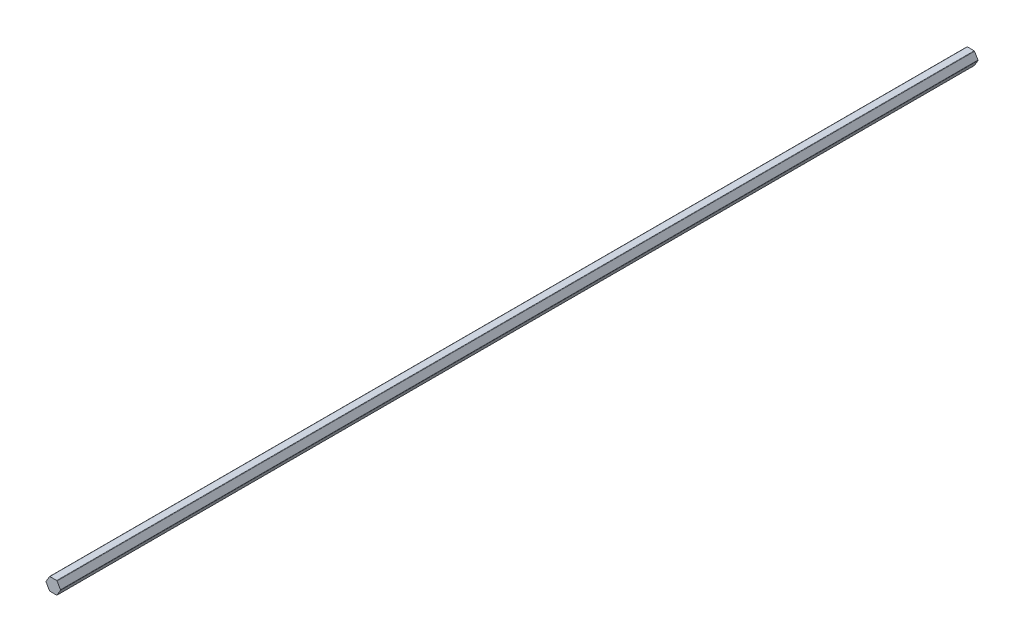
ISO-10303-21;
HEADER;
FILE_DESCRIPTION(('STEP AP214'),'2;1');
FILE_NAME('part.step','',(''),(''),'','','');
FILE_SCHEMA(('AUTOMOTIVE_DESIGN { 1 0 10303 214 1 1 1 1 }'));
ENDSEC;
DATA;
#1=APPLICATION_CONTEXT('core data for automotive mechanical design processes');
#2=APPLICATION_PROTOCOL_DEFINITION('international standard','automotive_design',2000,#1);
#3=PRODUCT_CONTEXT('',#1,'mechanical');
#4=PRODUCT('Part','Part','',(#3));
#5=PRODUCT_RELATED_PRODUCT_CATEGORY('part','',(#4));
#6=PRODUCT_DEFINITION_FORMATION('','',#4);
#7=PRODUCT_DEFINITION_CONTEXT('part definition',#1,'design');
#8=PRODUCT_DEFINITION('design','',#6,#7);
#9=PRODUCT_DEFINITION_SHAPE('','',#8);
#10=(LENGTH_UNIT() NAMED_UNIT(*) SI_UNIT(.MILLI.,.METRE.));
#11=(NAMED_UNIT(*) PLANE_ANGLE_UNIT() SI_UNIT($,.RADIAN.));
#12=(NAMED_UNIT(*) SI_UNIT($,.STERADIAN.) SOLID_ANGLE_UNIT());
#13=UNCERTAINTY_MEASURE_WITH_UNIT(LENGTH_MEASURE(1.E-05),#10,'distance_accuracy_value','');
#14=(GEOMETRIC_REPRESENTATION_CONTEXT(3) GLOBAL_UNCERTAINTY_ASSIGNED_CONTEXT((#13)) GLOBAL_UNIT_ASSIGNED_CONTEXT((#10,
#11,#12)) REPRESENTATION_CONTEXT('',''));
#15=CARTESIAN_POINT('',(0.,0.,0.));
#16=DIRECTION('',(0.,0.,1.));
#17=DIRECTION('',(1.,0.,0.));
#18=AXIS2_PLACEMENT_3D('',#15,#16,#17);
#19=CARTESIAN_POINT('',(3.36554792418709,5.8293,457.2));
#20=DIRECTION('',(0.,0.,-1.));
#21=DIRECTION('',(-1.,0.,0.));
#22=AXIS2_PLACEMENT_3D('',#19,#20,#21);
#23=CYLINDRICAL_SURFACE('',#22,0.508);
#24=CARTESIAN_POINT('',(3.36554792418709,5.8293,457.2));
#25=DIRECTION('',(0.,0.,1.));
#26=DIRECTION('',(1.,0.,0.));
#27=AXIS2_PLACEMENT_3D('',#24,#25,#26);
#28=CIRCLE('',#27,0.508);
#29=CARTESIAN_POINT('',(3.80548882930957,6.0833,457.2));
#30=VERTEX_POINT('',#29);
#31=CARTESIAN_POINT('',(3.36554792418709,6.3373,457.2));
#32=VERTEX_POINT('',#31);
#33=EDGE_CURVE('E20',#30,#32,#28,.T.);
#34=ORIENTED_EDGE('',*,*,#33,.F.);
#35=DIRECTION('',(0.,0.,1.));
#36=VECTOR('',#35,1.);
#37=CARTESIAN_POINT('',(3.80548882930958,6.0833,457.2));
#38=LINE('',#37,#36);
#39=CARTESIAN_POINT('',(3.80548882930957,6.0833,-457.2));
#40=VERTEX_POINT('',#39);
#41=EDGE_CURVE('E175',#40,#30,#38,.T.);
#42=ORIENTED_EDGE('',*,*,#41,.F.);
#43=CARTESIAN_POINT('',(3.36554792418709,5.8293,-457.2));
#44=DIRECTION('',(0.,0.,-1.));
#45=DIRECTION('',(1.,0.,0.));
#46=AXIS2_PLACEMENT_3D('',#43,#44,#45);
#47=CIRCLE('',#46,0.508);
#48=CARTESIAN_POINT('',(3.36554792418709,6.3373,-457.2));
#49=VERTEX_POINT('',#48);
#50=EDGE_CURVE('E161',#49,#40,#47,.T.);
#51=ORIENTED_EDGE('',*,*,#50,.F.);
#52=DIRECTION('',(0.,0.,-1.));
#53=VECTOR('',#52,1.);
#54=CARTESIAN_POINT('',(3.36554792418709,6.3373,457.2));
#55=LINE('',#54,#53);
#56=EDGE_CURVE('E177',#32,#49,#55,.T.);
#57=ORIENTED_EDGE('',*,*,#56,.F.);
#58=EDGE_LOOP('',(#34,#42,#51,#57));
#59=FACE_BOUND('',#58,.T.);
#60=ADVANCED_FACE('F16',(#59),#23,.T.);
#61=CARTESIAN_POINT('',(-3.36554792418709,5.8293,457.2));
#62=DIRECTION('',(0.,0.,-1.));
#63=DIRECTION('',(-1.,0.,0.));
#64=AXIS2_PLACEMENT_3D('',#61,#62,#63);
#65=CYLINDRICAL_SURFACE('',#64,0.508);
#66=CARTESIAN_POINT('',(-3.36554792418709,5.8293,457.2));
#67=DIRECTION('',(0.,0.,1.));
#68=DIRECTION('',(1.,0.,0.));
#69=AXIS2_PLACEMENT_3D('',#66,#67,#68);
#70=CIRCLE('',#69,0.508);
#71=CARTESIAN_POINT('',(-3.36554792418708,6.3373,457.2));
#72=VERTEX_POINT('',#71);
#73=CARTESIAN_POINT('',(-3.80548882930958,6.0833,457.2));
#74=VERTEX_POINT('',#73);
#75=EDGE_CURVE('E137',#72,#74,#70,.T.);
#76=ORIENTED_EDGE('',*,*,#75,.F.);
#77=DIRECTION('',(0.,0.,1.));
#78=VECTOR('',#77,1.);
#79=CARTESIAN_POINT('',(-3.36554792418709,6.3373,457.2));
#80=LINE('',#79,#78);
#81=CARTESIAN_POINT('',(-3.36554792418708,6.3373,-457.2));
#82=VERTEX_POINT('',#81);
#83=EDGE_CURVE('E195',#82,#72,#80,.T.);
#84=ORIENTED_EDGE('',*,*,#83,.F.);
#85=CARTESIAN_POINT('',(-3.36554792418709,5.8293,-457.2));
#86=DIRECTION('',(0.,0.,-1.));
#87=DIRECTION('',(1.,0.,0.));
#88=AXIS2_PLACEMENT_3D('',#85,#86,#87);
#89=CIRCLE('',#88,0.508);
#90=CARTESIAN_POINT('',(-3.80548882930958,6.0833,-457.2));
#91=VERTEX_POINT('',#90);
#92=EDGE_CURVE('E190',#91,#82,#89,.T.);
#93=ORIENTED_EDGE('',*,*,#92,.F.);
#94=DIRECTION('',(0.,0.,-1.));
#95=VECTOR('',#94,1.);
#96=CARTESIAN_POINT('',(-3.80548882930958,6.0833,457.2));
#97=LINE('',#96,#95);
#98=EDGE_CURVE('E210',#74,#91,#97,.T.);
#99=ORIENTED_EDGE('',*,*,#98,.F.);
#100=EDGE_LOOP('',(#76,#84,#93,#99));
#101=FACE_BOUND('',#100,.T.);
#102=ADVANCED_FACE('F298',(#101),#65,.T.);
#103=CARTESIAN_POINT('',(6.73109584837417,0.,457.2));
#104=DIRECTION('',(0.,0.,-1.));
#105=DIRECTION('',(-1.,0.,0.));
#106=AXIS2_PLACEMENT_3D('',#103,#104,#105);
#107=CYLINDRICAL_SURFACE('',#106,0.508);
#108=CARTESIAN_POINT('',(6.73109584837417,0.,457.2));
#109=DIRECTION('',(0.,0.,1.));
#110=DIRECTION('',(1.,0.,0.));
#111=AXIS2_PLACEMENT_3D('',#108,#109,#110);
#112=CIRCLE('',#111,0.508);
#113=CARTESIAN_POINT('',(7.17103675349666,-0.254,457.2));
#114=VERTEX_POINT('',#113);
#115=CARTESIAN_POINT('',(7.17103675349666,0.254000000000004,457.2));
#116=VERTEX_POINT('',#115);
#117=EDGE_CURVE('E252',#114,#116,#112,.T.);
#118=ORIENTED_EDGE('',*,*,#117,.F.);
#119=DIRECTION('',(0.,0.,1.));
#120=VECTOR('',#119,1.);
#121=CARTESIAN_POINT('',(7.17103675349667,-0.253999999999996,457.2));
#122=LINE('',#121,#120);
#123=CARTESIAN_POINT('',(7.17103675349666,-0.254,-457.2));
#124=VERTEX_POINT('',#123);
#125=EDGE_CURVE('E226',#124,#114,#122,.T.);
#126=ORIENTED_EDGE('',*,*,#125,.F.);
#127=CARTESIAN_POINT('',(6.73109584837417,0.,-457.2));
#128=DIRECTION('',(0.,0.,-1.));
#129=DIRECTION('',(1.,0.,0.));
#130=AXIS2_PLACEMENT_3D('',#127,#128,#129);
#131=CIRCLE('',#130,0.508);
#132=CARTESIAN_POINT('',(7.17103675349666,0.254000000000004,-457.2));
#133=VERTEX_POINT('',#132);
#134=EDGE_CURVE('E27',#133,#124,#131,.T.);
#135=ORIENTED_EDGE('',*,*,#134,.F.);
#136=DIRECTION('',(0.,0.,-1.));
#137=VECTOR('',#136,1.);
#138=CARTESIAN_POINT('',(7.17103675349666,0.254,457.2));
#139=LINE('',#138,#137);
#140=EDGE_CURVE('E176',#116,#133,#139,.T.);
#141=ORIENTED_EDGE('',*,*,#140,.F.);
#142=EDGE_LOOP('',(#118,#126,#135,#141));
#143=FACE_BOUND('',#142,.T.);
#144=ADVANCED_FACE('F419',(#143),#107,.T.);
#145=CARTESIAN_POINT('',(3.36554792418709,-5.8293,457.2));
#146=DIRECTION('',(0.,0.,-1.));
#147=DIRECTION('',(-1.,0.,0.));
#148=AXIS2_PLACEMENT_3D('',#145,#146,#147);
#149=CYLINDRICAL_SURFACE('',#148,0.508);
#150=CARTESIAN_POINT('',(3.36554792418709,-5.8293,457.2));
#151=DIRECTION('',(0.,0.,1.));
#152=DIRECTION('',(1.,0.,0.));
#153=AXIS2_PLACEMENT_3D('',#150,#151,#152);
#154=CIRCLE('',#153,0.508);
#155=CARTESIAN_POINT('',(3.36554792418709,-6.3373,457.2));
#156=VERTEX_POINT('',#155);
#157=CARTESIAN_POINT('',(3.80548882930958,-6.0833,457.2));
#158=VERTEX_POINT('',#157);
#159=EDGE_CURVE('E169',#156,#158,#154,.T.);
#160=ORIENTED_EDGE('',*,*,#159,.F.);
#161=DIRECTION('',(0.,0.,1.));
#162=VECTOR('',#161,1.);
#163=CARTESIAN_POINT('',(3.36554792418709,-6.3373,457.2));
#164=LINE('',#163,#162);
#165=CARTESIAN_POINT('',(3.36554792418709,-6.3373,-457.2));
#166=VERTEX_POINT('',#165);
#167=EDGE_CURVE('E170',#166,#156,#164,.T.);
#168=ORIENTED_EDGE('',*,*,#167,.F.);
#169=CARTESIAN_POINT('',(3.36554792418709,-5.8293,-457.2));
#170=DIRECTION('',(0.,0.,-1.));
#171=DIRECTION('',(1.,0.,0.));
#172=AXIS2_PLACEMENT_3D('',#169,#170,#171);
#173=CIRCLE('',#172,0.508);
#174=CARTESIAN_POINT('',(3.80548882930958,-6.0833,-457.2));
#175=VERTEX_POINT('',#174);
#176=EDGE_CURVE('E10',#175,#166,#173,.T.);
#177=ORIENTED_EDGE('',*,*,#176,.F.);
#178=DIRECTION('',(0.,0.,-1.));
#179=VECTOR('',#178,1.);
#180=CARTESIAN_POINT('',(3.80548882930958,-6.0833,457.2));
#181=LINE('',#180,#179);
#182=EDGE_CURVE('E227',#158,#175,#181,.T.);
#183=ORIENTED_EDGE('',*,*,#182,.F.);
#184=EDGE_LOOP('',(#160,#168,#177,#183));
#185=FACE_BOUND('',#184,.T.);
#186=ADVANCED_FACE('F416',(#185),#149,.T.);
#187=CARTESIAN_POINT('',(-6.73109584837417,0.,457.2));
#188=DIRECTION('',(0.,0.,-1.));
#189=DIRECTION('',(-1.,0.,0.));
#190=AXIS2_PLACEMENT_3D('',#187,#188,#189);
#191=CYLINDRICAL_SURFACE('',#190,0.508);
#192=DIRECTION('',(0.,0.,-1.));
#193=VECTOR('',#192,1.);
#194=CARTESIAN_POINT('',(-7.23909584837417,0.,457.2));
#195=LINE('',#194,#193);
#196=CARTESIAN_POINT('',(-7.23909584837417,0.,457.2));
#197=VERTEX_POINT('',#196);
#198=CARTESIAN_POINT('',(-7.23909584837417,0.,-457.2));
#199=VERTEX_POINT('',#198);
#200=EDGE_CURVE('E140',#197,#199,#195,.T.);
#201=ORIENTED_EDGE('',*,*,#200,.F.);
#202=CARTESIAN_POINT('',(-6.73109584837417,0.,457.2));
#203=DIRECTION('',(0.,0.,1.));
#204=DIRECTION('',(1.,0.,0.));
#205=AXIS2_PLACEMENT_3D('',#202,#203,#204);
#206=CIRCLE('',#205,0.508);
#207=CARTESIAN_POINT('',(-7.17103675349666,0.253999999999997,457.2));
#208=VERTEX_POINT('',#207);
#209=EDGE_CURVE('E125',#208,#197,#206,.T.);
#210=ORIENTED_EDGE('',*,*,#209,.F.);
#211=DIRECTION('',(0.,0.,1.));
#212=VECTOR('',#211,1.);
#213=CARTESIAN_POINT('',(-7.17103675349666,0.253999999999995,457.2));
#214=LINE('',#213,#212);
#215=CARTESIAN_POINT('',(-7.17103675349666,0.253999999999997,-457.2));
#216=VERTEX_POINT('',#215);
#217=EDGE_CURVE('E239',#216,#208,#214,.T.);
#218=ORIENTED_EDGE('',*,*,#217,.F.);
#219=CARTESIAN_POINT('',(-6.73109584837417,0.,-457.2));
#220=DIRECTION('',(0.,0.,-1.));
#221=DIRECTION('',(1.,0.,0.));
#222=AXIS2_PLACEMENT_3D('',#219,#220,#221);
#223=CIRCLE('',#222,0.508);
#224=EDGE_CURVE('E143',#199,#216,#223,.T.);
#225=ORIENTED_EDGE('',*,*,#224,.F.);
#226=EDGE_LOOP('',(#201,#210,#218,#225));
#227=FACE_BOUND('',#226,.T.);
#228=ADVANCED_FACE('F141',(#227),#191,.T.);
#229=CARTESIAN_POINT('',(-3.36554792418708,-5.8293,457.2));
#230=DIRECTION('',(0.,0.,-1.));
#231=DIRECTION('',(-1.,0.,0.));
#232=AXIS2_PLACEMENT_3D('',#229,#230,#231);
#233=CYLINDRICAL_SURFACE('',#232,0.508);
#234=CARTESIAN_POINT('',(-3.36554792418708,-5.8293,457.2));
#235=DIRECTION('',(0.,0.,1.));
#236=DIRECTION('',(1.,0.,0.));
#237=AXIS2_PLACEMENT_3D('',#234,#235,#236);
#238=CIRCLE('',#237,0.508);
#239=CARTESIAN_POINT('',(-3.80548882930957,-6.0833,457.2));
#240=VERTEX_POINT('',#239);
#241=CARTESIAN_POINT('',(-3.36554792418708,-6.3373,457.2));
#242=VERTEX_POINT('',#241);
#243=EDGE_CURVE('E166',#240,#242,#238,.T.);
#244=ORIENTED_EDGE('',*,*,#243,.F.);
#245=DIRECTION('',(0.,0.,1.));
#246=VECTOR('',#245,1.);
#247=CARTESIAN_POINT('',(-3.80548882930957,-6.0833,457.2));
#248=LINE('',#247,#246);
#249=CARTESIAN_POINT('',(-3.80548882930957,-6.0833,-457.2));
#250=VERTEX_POINT('',#249);
#251=EDGE_CURVE('E187',#250,#240,#248,.T.);
#252=ORIENTED_EDGE('',*,*,#251,.F.);
#253=CARTESIAN_POINT('',(-3.36554792418708,-5.8293,-457.2));
#254=DIRECTION('',(0.,0.,-1.));
#255=DIRECTION('',(1.,0.,0.));
#256=AXIS2_PLACEMENT_3D('',#253,#254,#255);
#257=CIRCLE('',#256,0.508);
#258=CARTESIAN_POINT('',(-3.36554792418708,-6.3373,-457.2));
#259=VERTEX_POINT('',#258);
#260=EDGE_CURVE('E136',#259,#250,#257,.T.);
#261=ORIENTED_EDGE('',*,*,#260,.F.);
#262=DIRECTION('',(0.,0.,-1.));
#263=VECTOR('',#262,1.);
#264=CARTESIAN_POINT('',(-3.36554792418708,-6.3373,457.2));
#265=LINE('',#264,#263);
#266=EDGE_CURVE('E235',#242,#259,#265,.T.);
#267=ORIENTED_EDGE('',*,*,#266,.F.);
#268=EDGE_LOOP('',(#244,#252,#261,#267));
#269=FACE_BOUND('',#268,.T.);
#270=ADVANCED_FACE('F285',(#269),#233,.T.);
#271=CARTESIAN_POINT('',(7.31768372187083,0.,-457.2));
#272=DIRECTION('',(0.,0.,1.));
#273=DIRECTION('',(1.,0.,0.));
#274=AXIS2_PLACEMENT_3D('',#271,#272,#273);
#275=PLANE('',#274);
#276=DIRECTION('',(1.,0.,0.));
#277=VECTOR('',#276,1.);
#278=CARTESIAN_POINT('',(-3.6588418609354,-6.3373,-457.2));
#279=LINE('',#278,#277);
#280=EDGE_CURVE('E243',#259,#166,#279,.T.);
#281=ORIENTED_EDGE('',*,*,#280,.F.);
#282=ORIENTED_EDGE('',*,*,#260,.T.);
#283=DIRECTION('',(0.5,-0.866025403784439,0.));
#284=VECTOR('',#283,1.);
#285=CARTESIAN_POINT('',(-7.31768372187083,0.,-457.2));
#286=LINE('',#285,#284);
#287=CARTESIAN_POINT('',(-7.17103675349666,-0.254000000000004,-457.2));
#288=VERTEX_POINT('',#287);
#289=EDGE_CURVE('E203',#288,#250,#286,.T.);
#290=ORIENTED_EDGE('',*,*,#289,.F.);
#291=CARTESIAN_POINT('',(-6.73109584837417,0.,-457.2));
#292=DIRECTION('',(0.,0.,-1.));
#293=DIRECTION('',(1.,0.,0.));
#294=AXIS2_PLACEMENT_3D('',#291,#292,#293);
#295=CIRCLE('',#294,0.508);
#296=EDGE_CURVE('E148',#288,#199,#295,.T.);
#297=ORIENTED_EDGE('',*,*,#296,.T.);
#298=ORIENTED_EDGE('',*,*,#224,.T.);
#299=DIRECTION('',(-0.5,-0.866025403784439,0.));
#300=VECTOR('',#299,1.);
#301=CARTESIAN_POINT('',(-3.65884186093541,6.3373,-457.2));
#302=LINE('',#301,#300);
#303=EDGE_CURVE('E181',#91,#216,#302,.T.);
#304=ORIENTED_EDGE('',*,*,#303,.F.);
#305=ORIENTED_EDGE('',*,*,#92,.T.);
#306=DIRECTION('',(-1.,0.,0.));
#307=VECTOR('',#306,1.);
#308=CARTESIAN_POINT('',(3.65884186093541,6.3373,-457.2));
#309=LINE('',#308,#307);
#310=EDGE_CURVE('E191',#49,#82,#309,.T.);
#311=ORIENTED_EDGE('',*,*,#310,.F.);
#312=ORIENTED_EDGE('',*,*,#50,.T.);
#313=DIRECTION('',(-0.5,0.866025403784439,0.));
#314=VECTOR('',#313,1.);
#315=CARTESIAN_POINT('',(7.31768372187083,0.,-457.2));
#316=LINE('',#315,#314);
#317=EDGE_CURVE('E171',#133,#40,#316,.T.);
#318=ORIENTED_EDGE('',*,*,#317,.F.);
#319=ORIENTED_EDGE('',*,*,#134,.T.);
#320=DIRECTION('',(0.5,0.866025403784439,0.));
#321=VECTOR('',#320,1.);
#322=CARTESIAN_POINT('',(3.65884186093541,-6.3373,-457.2));
#323=LINE('',#322,#321);
#324=EDGE_CURVE('E222',#175,#124,#323,.T.);
#325=ORIENTED_EDGE('',*,*,#324,.F.);
#326=ORIENTED_EDGE('',*,*,#176,.T.);
#327=EDGE_LOOP('',(#281,#282,#290,#297,#298,#304,#305,#311,#312,#318,#319,#325,#326));
#328=FACE_BOUND('',#327,.T.);
#329=ADVANCED_FACE('F282',(#328),#275,.F.);
#330=CARTESIAN_POINT('',(7.31768372187083,0.,457.2));
#331=DIRECTION('',(0.,0.,1.));
#332=DIRECTION('',(1.,0.,0.));
#333=AXIS2_PLACEMENT_3D('',#330,#331,#332);
#334=PLANE('',#333);
#335=DIRECTION('',(0.5,-0.866025403784439,0.));
#336=VECTOR('',#335,1.);
#337=CARTESIAN_POINT('',(-7.31768372187083,0.,457.2));
#338=LINE('',#337,#336);
#339=CARTESIAN_POINT('',(-7.17103675349666,-0.254000000000004,457.2));
#340=VERTEX_POINT('',#339);
#341=EDGE_CURVE('E183',#340,#240,#338,.T.);
#342=ORIENTED_EDGE('',*,*,#341,.T.);
#343=ORIENTED_EDGE('',*,*,#243,.T.);
#344=DIRECTION('',(1.,0.,0.));
#345=VECTOR('',#344,1.);
#346=CARTESIAN_POINT('',(-3.6588418609354,-6.3373,457.2));
#347=LINE('',#346,#345);
#348=EDGE_CURVE('E186',#242,#156,#347,.T.);
#349=ORIENTED_EDGE('',*,*,#348,.T.);
#350=ORIENTED_EDGE('',*,*,#159,.T.);
#351=DIRECTION('',(0.5,0.866025403784439,0.));
#352=VECTOR('',#351,1.);
#353=CARTESIAN_POINT('',(3.65884186093541,-6.3373,457.2));
#354=LINE('',#353,#352);
#355=EDGE_CURVE('E165',#158,#114,#354,.T.);
#356=ORIENTED_EDGE('',*,*,#355,.T.);
#357=ORIENTED_EDGE('',*,*,#117,.T.);
#358=DIRECTION('',(-0.5,0.866025403784439,0.));
#359=VECTOR('',#358,1.);
#360=CARTESIAN_POINT('',(7.31768372187083,0.,457.2));
#361=LINE('',#360,#359);
#362=EDGE_CURVE('E231',#116,#30,#361,.T.);
#363=ORIENTED_EDGE('',*,*,#362,.T.);
#364=ORIENTED_EDGE('',*,*,#33,.T.);
#365=DIRECTION('',(-1.,0.,0.));
#366=VECTOR('',#365,1.);
#367=CARTESIAN_POINT('',(3.65884186093541,6.3373,457.2));
#368=LINE('',#367,#366);
#369=EDGE_CURVE('E182',#32,#72,#368,.T.);
#370=ORIENTED_EDGE('',*,*,#369,.T.);
#371=ORIENTED_EDGE('',*,*,#75,.T.);
#372=DIRECTION('',(-0.5,-0.866025403784439,0.));
#373=VECTOR('',#372,1.);
#374=CARTESIAN_POINT('',(-3.65884186093541,6.3373,457.2));
#375=LINE('',#374,#373);
#376=EDGE_CURVE('E131',#74,#208,#375,.T.);
#377=ORIENTED_EDGE('',*,*,#376,.T.);
#378=ORIENTED_EDGE('',*,*,#209,.T.);
#379=CARTESIAN_POINT('',(-6.73109584837417,0.,457.2));
#380=DIRECTION('',(0.,0.,1.));
#381=DIRECTION('',(1.,0.,0.));
#382=AXIS2_PLACEMENT_3D('',#379,#380,#381);
#383=CIRCLE('',#382,0.508);
#384=EDGE_CURVE('E129',#197,#340,#383,.T.);
#385=ORIENTED_EDGE('',*,*,#384,.T.);
#386=EDGE_LOOP('',(#342,#343,#349,#350,#356,#357,#363,#364,#370,#371,#377,#378,#385));
#387=FACE_BOUND('',#386,.T.);
#388=ADVANCED_FACE('F18',(#387),#334,.T.);
#389=CARTESIAN_POINT('',(-3.6588418609354,-6.3373,457.2));
#390=DIRECTION('',(0.,1.,0.));
#391=DIRECTION('',(1.,0.,0.));
#392=AXIS2_PLACEMENT_3D('',#389,#390,#391);
#393=PLANE('',#392);
#394=ORIENTED_EDGE('',*,*,#348,.F.);
#395=ORIENTED_EDGE('',*,*,#266,.T.);
#396=ORIENTED_EDGE('',*,*,#280,.T.);
#397=ORIENTED_EDGE('',*,*,#167,.T.);
#398=EDGE_LOOP('',(#394,#395,#396,#397));
#399=FACE_BOUND('',#398,.T.);
#400=ADVANCED_FACE('F453',(#399),#393,.F.);
#401=CARTESIAN_POINT('',(-7.31768372187083,0.,457.2));
#402=DIRECTION('',(0.866025403784438,0.5,0.));
#403=DIRECTION('',(0.,0.,-1.));
#404=AXIS2_PLACEMENT_3D('',#401,#402,#403);
#405=PLANE('',#404);
#406=ORIENTED_EDGE('',*,*,#289,.T.);
#407=ORIENTED_EDGE('',*,*,#251,.T.);
#408=ORIENTED_EDGE('',*,*,#341,.F.);
#409=DIRECTION('',(0.,0.,-1.));
#410=VECTOR('',#409,1.);
#411=CARTESIAN_POINT('',(-7.17103675349666,-0.254000000000004,457.2));
#412=LINE('',#411,#410);
#413=EDGE_CURVE('E153',#340,#288,#412,.T.);
#414=ORIENTED_EDGE('',*,*,#413,.T.);
#415=EDGE_LOOP('',(#406,#407,#408,#414));
#416=FACE_BOUND('',#415,.T.);
#417=ADVANCED_FACE('F287',(#416),#405,.F.);
#418=CARTESIAN_POINT('',(-3.65884186093541,6.3373,457.2));
#419=DIRECTION('',(0.866025403784439,-0.5,0.));
#420=DIRECTION('',(0.,0.,-1.));
#421=AXIS2_PLACEMENT_3D('',#418,#419,#420);
#422=PLANE('',#421);
#423=ORIENTED_EDGE('',*,*,#303,.T.);
#424=ORIENTED_EDGE('',*,*,#217,.T.);
#425=ORIENTED_EDGE('',*,*,#376,.F.);
#426=ORIENTED_EDGE('',*,*,#98,.T.);
#427=EDGE_LOOP('',(#423,#424,#425,#426));
#428=FACE_BOUND('',#427,.T.);
#429=ADVANCED_FACE('F294',(#428),#422,.F.);
#430=CARTESIAN_POINT('',(3.65884186093541,6.3373,457.2));
#431=DIRECTION('',(0.,-1.,0.));
#432=DIRECTION('',(0.,0.,-1.));
#433=AXIS2_PLACEMENT_3D('',#430,#431,#432);
#434=PLANE('',#433);
#435=ORIENTED_EDGE('',*,*,#310,.T.);
#436=ORIENTED_EDGE('',*,*,#83,.T.);
#437=ORIENTED_EDGE('',*,*,#369,.F.);
#438=ORIENTED_EDGE('',*,*,#56,.T.);
#439=EDGE_LOOP('',(#435,#436,#437,#438));
#440=FACE_BOUND('',#439,.T.);
#441=ADVANCED_FACE('F426',(#440),#434,.F.);
#442=CARTESIAN_POINT('',(7.31768372187083,0.,457.2));
#443=DIRECTION('',(-0.866025403784439,-0.5,0.));
#444=DIRECTION('',(-0.5,0.866025403784439,0.));
#445=AXIS2_PLACEMENT_3D('',#442,#443,#444);
#446=PLANE('',#445);
#447=ORIENTED_EDGE('',*,*,#362,.F.);
#448=ORIENTED_EDGE('',*,*,#140,.T.);
#449=ORIENTED_EDGE('',*,*,#317,.T.);
#450=ORIENTED_EDGE('',*,*,#41,.T.);
#451=EDGE_LOOP('',(#447,#448,#449,#450));
#452=FACE_BOUND('',#451,.T.);
#453=ADVANCED_FACE('F422',(#452),#446,.F.);
#454=CARTESIAN_POINT('',(3.65884186093541,-6.3373,457.2));
#455=DIRECTION('',(-0.866025403784439,0.5,0.));
#456=DIRECTION('',(0.,0.,1.));
#457=AXIS2_PLACEMENT_3D('',#454,#455,#456);
#458=PLANE('',#457);
#459=ORIENTED_EDGE('',*,*,#355,.F.);
#460=ORIENTED_EDGE('',*,*,#182,.T.);
#461=ORIENTED_EDGE('',*,*,#324,.T.);
#462=ORIENTED_EDGE('',*,*,#125,.T.);
#463=EDGE_LOOP('',(#459,#460,#461,#462));
#464=FACE_BOUND('',#463,.T.);
#465=ADVANCED_FACE('F418',(#464),#458,.F.);
#466=CARTESIAN_POINT('',(-6.73109584837417,0.,457.2));
#467=DIRECTION('',(0.,0.,-1.));
#468=DIRECTION('',(-1.,0.,0.));
#469=AXIS2_PLACEMENT_3D('',#466,#467,#468);
#470=CYLINDRICAL_SURFACE('',#469,0.508);
#471=ORIENTED_EDGE('',*,*,#384,.F.);
#472=ORIENTED_EDGE('',*,*,#200,.T.);
#473=ORIENTED_EDGE('',*,*,#296,.F.);
#474=ORIENTED_EDGE('',*,*,#413,.F.);
#475=EDGE_LOOP('',(#471,#472,#473,#474));
#476=FACE_BOUND('',#475,.T.);
#477=ADVANCED_FACE('F151',(#476),#470,.T.);
#478=CLOSED_SHELL('',(#60,#102,#144,#186,#228,#270,#329,#388,#400,#417,#429,#441,#453,#465,#477));
#479=MANIFOLD_SOLID_BREP('B1',#478);
#480=ADVANCED_BREP_SHAPE_REPRESENTATION('',(#18,#479),#14);
#481=SHAPE_DEFINITION_REPRESENTATION(#9,#480);
ENDSEC;
END-ISO-10303-21;
